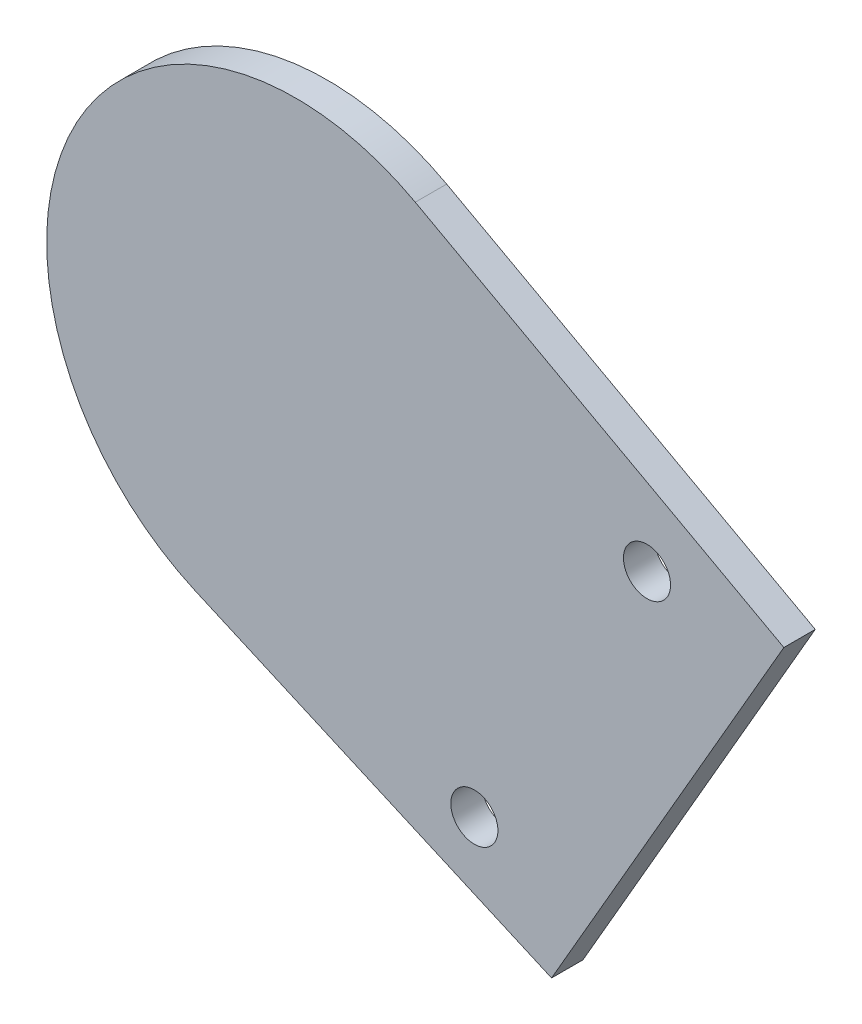
ISO-10303-21;
HEADER;
FILE_DESCRIPTION(('STEP AP214'),'2;1');
FILE_NAME('part.step','',(''),(''),'','','');
FILE_SCHEMA(('AUTOMOTIVE_DESIGN { 1 0 10303 214 1 1 1 1 }'));
ENDSEC;
DATA;
#1=APPLICATION_CONTEXT('core data for automotive mechanical design processes');
#2=APPLICATION_PROTOCOL_DEFINITION('international standard','automotive_design',2000,#1);
#3=PRODUCT_CONTEXT('',#1,'mechanical');
#4=PRODUCT('Part','Part','',(#3));
#5=PRODUCT_RELATED_PRODUCT_CATEGORY('part','',(#4));
#6=PRODUCT_DEFINITION_FORMATION('','',#4);
#7=PRODUCT_DEFINITION_CONTEXT('part definition',#1,'design');
#8=PRODUCT_DEFINITION('design','',#6,#7);
#9=PRODUCT_DEFINITION_SHAPE('','',#8);
#10=(LENGTH_UNIT() NAMED_UNIT(*) SI_UNIT(.MILLI.,.METRE.));
#11=(NAMED_UNIT(*) PLANE_ANGLE_UNIT() SI_UNIT($,.RADIAN.));
#12=(NAMED_UNIT(*) SI_UNIT($,.STERADIAN.) SOLID_ANGLE_UNIT());
#13=UNCERTAINTY_MEASURE_WITH_UNIT(LENGTH_MEASURE(1.E-05),#10,'distance_accuracy_value','');
#14=(GEOMETRIC_REPRESENTATION_CONTEXT(3) GLOBAL_UNCERTAINTY_ASSIGNED_CONTEXT((#13)) GLOBAL_UNIT_ASSIGNED_CONTEXT((#10,
#11,#12)) REPRESENTATION_CONTEXT('',''));
#15=CARTESIAN_POINT('',(0.,0.,0.));
#16=DIRECTION('',(0.,0.,1.));
#17=DIRECTION('',(1.,0.,0.));
#18=AXIS2_PLACEMENT_3D('',#15,#16,#17);
#19=CARTESIAN_POINT('',(8.61285407631744,27.3164832240439,-1.));
#20=DIRECTION('',(0.30070579948342,0.953716950754802,0.));
#21=DIRECTION('',(-0.953716950754802,0.30070579948342,0.));
#22=AXIS2_PLACEMENT_3D('',#19,#20,#21);
#23=PLANE('',#22);
#24=DIRECTION('',(-0.953716950754802,0.30070579948342,0.));
#25=VECTOR('',#24,1.);
#26=CARTESIAN_POINT('',(8.61285407631744,27.3164832240439,0.));
#27=LINE('',#26,#25);
#28=CARTESIAN_POINT('',(8.04581507237981,27.4952699352189,0.));
#29=VERTEX_POINT('',#28);
#30=CARTESIAN_POINT('',(-0.183811683162791,30.0900612839698,0.));
#31=VERTEX_POINT('',#30);
#32=EDGE_CURVE('E119',#29,#31,#27,.T.);
#33=ORIENTED_EDGE('',*,*,#32,.T.);
#34=DIRECTION('',(0.,0.,1.));
#35=VECTOR('',#34,1.);
#36=CARTESIAN_POINT('',(-0.183811683162791,30.0900612839698,-1.));
#37=LINE('',#36,#35);
#38=CARTESIAN_POINT('',(-0.183811683162791,30.0900612839698,-1.));
#39=VERTEX_POINT('',#38);
#40=EDGE_CURVE('E11',#39,#31,#37,.T.);
#41=ORIENTED_EDGE('',*,*,#40,.F.);
#42=DIRECTION('',(-0.953716950754802,0.30070579948342,0.));
#43=VECTOR('',#42,1.);
#44=CARTESIAN_POINT('',(8.61285407631744,27.3164832240439,-1.));
#45=LINE('',#44,#43);
#46=CARTESIAN_POINT('',(8.04581507237981,27.4952699352189,-1.));
#47=VERTEX_POINT('',#46);
#48=EDGE_CURVE('E53',#47,#39,#45,.T.);
#49=ORIENTED_EDGE('',*,*,#48,.F.);
#50=DIRECTION('',(0.,0.,1.));
#51=VECTOR('',#50,1.);
#52=CARTESIAN_POINT('',(8.04581507237981,27.4952699352189,-1.));
#53=LINE('',#52,#51);
#54=EDGE_CURVE('E38',#47,#29,#53,.T.);
#55=ORIENTED_EDGE('',*,*,#54,.T.);
#56=EDGE_LOOP('',(#33,#41,#49,#55));
#57=FACE_BOUND('',#56,.T.);
#58=ADVANCED_FACE('F35',(#57),#23,.F.);
#59=CARTESIAN_POINT('',(-6.66733957619966,41.2134371681631,-1.));
#60=DIRECTION('',(0.,0.,1.));
#61=DIRECTION('',(1.,0.,0.));
#62=AXIS2_PLACEMENT_3D('',#59,#60,#61);
#63=CYLINDRICAL_SURFACE('',#62,12.8750000000327);
#64=CARTESIAN_POINT('',(-6.66733957619966,41.2134371681631,0.));
#65=DIRECTION('',(0.,0.,1.));
#66=DIRECTION('',(1.,0.,0.));
#67=AXIS2_PLACEMENT_3D('',#64,#65,#66);
#68=CIRCLE('',#67,12.8750000000327);
#69=CARTESIAN_POINT('',(6.20755046187521,41.1602252491835,0.));
#70=VERTEX_POINT('',#69);
#71=EDGE_CURVE('E132',#70,#31,#68,.T.);
#72=ORIENTED_EDGE('',*,*,#71,.F.);
#73=DIRECTION('',(0.,0.,1.));
#74=VECTOR('',#73,1.);
#75=CARTESIAN_POINT('',(6.20755046187521,41.1602252491835,-1.));
#76=LINE('',#75,#74);
#77=CARTESIAN_POINT('',(6.20755046187521,41.1602252491835,-1.));
#78=VERTEX_POINT('',#77);
#79=EDGE_CURVE('E44',#78,#70,#76,.T.);
#80=ORIENTED_EDGE('',*,*,#79,.F.);
#81=CARTESIAN_POINT('',(-6.66733957619966,41.2134371681631,-1.));
#82=DIRECTION('',(0.,0.,1.));
#83=DIRECTION('',(1.,0.,0.));
#84=AXIS2_PLACEMENT_3D('',#81,#82,#83);
#85=CIRCLE('',#84,12.8750000000327);
#86=EDGE_CURVE('E109',#78,#39,#85,.T.);
#87=ORIENTED_EDGE('',*,*,#86,.T.);
#88=ORIENTED_EDGE('',*,*,#40,.T.);
#89=EDGE_LOOP('',(#72,#80,#87,#88));
#90=FACE_BOUND('',#89,.T.);
#91=ADVANCED_FACE('F145',(#90),#63,.T.);
#92=CARTESIAN_POINT('',(23.3350624785849,25.4657520533921,-1.));
#93=DIRECTION('',(0.675590207651282,0.737277336777483,0.));
#94=DIRECTION('',(-0.737277336777483,0.675590207651282,0.));
#95=AXIS2_PLACEMENT_3D('',#92,#93,#94);
#96=PLANE('',#95);
#97=DIRECTION('',(-0.737277336777483,0.675590207651282,0.));
#98=VECTOR('',#97,1.);
#99=CARTESIAN_POINT('',(23.3350624785849,25.4657520533921,0.));
#100=LINE('',#99,#98);
#101=CARTESIAN_POINT('',(12.5695190653247,35.3305550891572,0.));
#102=VERTEX_POINT('',#101);
#103=EDGE_CURVE('E99',#102,#70,#100,.T.);
#104=ORIENTED_EDGE('',*,*,#103,.F.);
#105=DIRECTION('',(0.,0.,1.));
#106=VECTOR('',#105,1.);
#107=CARTESIAN_POINT('',(12.5695190653247,35.3305550891572,-1.));
#108=LINE('',#107,#106);
#109=CARTESIAN_POINT('',(12.5695190653247,35.3305550891572,-1.));
#110=VERTEX_POINT('',#109);
#111=EDGE_CURVE('E75',#110,#102,#108,.T.);
#112=ORIENTED_EDGE('',*,*,#111,.F.);
#113=DIRECTION('',(-0.737277336777483,0.675590207651282,0.));
#114=VECTOR('',#113,1.);
#115=CARTESIAN_POINT('',(23.3350624785849,25.4657520533921,-1.));
#116=LINE('',#115,#114);
#117=EDGE_CURVE('E97',#110,#78,#116,.T.);
#118=ORIENTED_EDGE('',*,*,#117,.T.);
#119=ORIENTED_EDGE('',*,*,#79,.T.);
#120=EDGE_LOOP('',(#104,#112,#118,#119));
#121=FACE_BOUND('',#120,.T.);
#122=ADVANCED_FACE('F96',(#121),#96,.T.);
#123=CARTESIAN_POINT('',(9.43914661924816,31.9143530275722,-1.));
#124=DIRECTION('',(0.,0.,1.));
#125=DIRECTION('',(1.,0.,0.));
#126=AXIS2_PLACEMENT_3D('',#123,#124,#125);
#127=CYLINDRICAL_SURFACE('',#126,4.63353732872982);
#128=CARTESIAN_POINT('',(9.43914661924816,31.9143530275722,0.));
#129=DIRECTION('',(0.,0.,1.));
#130=DIRECTION('',(1.,0.,0.));
#131=AXIS2_PLACEMENT_3D('',#128,#129,#130);
#132=CIRCLE('',#131,4.63353732872982);
#133=CARTESIAN_POINT('',(13.8409345303533,33.3613953083579,0.));
#134=VERTEX_POINT('',#133);
#135=EDGE_CURVE('E129',#134,#102,#132,.T.);
#136=ORIENTED_EDGE('',*,*,#135,.F.);
#137=DIRECTION('',(0.,0.,1.));
#138=VECTOR('',#137,1.);
#139=CARTESIAN_POINT('',(13.8409345303533,33.3613953083579,-1.));
#140=LINE('',#139,#138);
#141=CARTESIAN_POINT('',(13.8409345303533,33.3613953083579,-1.));
#142=VERTEX_POINT('',#141);
#143=EDGE_CURVE('E101',#142,#134,#140,.T.);
#144=ORIENTED_EDGE('',*,*,#143,.F.);
#145=CARTESIAN_POINT('',(9.43914661924816,31.9143530275722,-1.));
#146=DIRECTION('',(0.,0.,1.));
#147=DIRECTION('',(1.,0.,0.));
#148=AXIS2_PLACEMENT_3D('',#145,#146,#147);
#149=CIRCLE('',#148,4.63353732872982);
#150=EDGE_CURVE('E106',#142,#110,#149,.T.);
#151=ORIENTED_EDGE('',*,*,#150,.T.);
#152=ORIENTED_EDGE('',*,*,#111,.T.);
#153=EDGE_LOOP('',(#136,#144,#151,#152));
#154=FACE_BOUND('',#153,.T.);
#155=ADVANCED_FACE('F111',(#154),#127,.T.);
#156=CARTESIAN_POINT('',(7.72752043028929,-1.36056634220429,-1.));
#157=DIRECTION('',(0.984851398652931,-0.173400468774928,0.));
#158=DIRECTION('',(0.173400468774928,0.984851398652931,0.));
#159=AXIS2_PLACEMENT_3D('',#156,#157,#158);
#160=PLANE('',#159);
#161=DIRECTION('',(0.173400468774928,0.984851398652931,0.));
#162=VECTOR('',#161,1.);
#163=CARTESIAN_POINT('',(7.72752043028929,-1.36056634220429,0.));
#164=LINE('',#163,#162);
#165=CARTESIAN_POINT('',(13.0819975429926,29.0509101131778,0.));
#166=VERTEX_POINT('',#165);
#167=EDGE_CURVE('E126',#166,#134,#164,.T.);
#168=ORIENTED_EDGE('',*,*,#167,.F.);
#169=DIRECTION('',(0.,0.,1.));
#170=VECTOR('',#169,1.);
#171=CARTESIAN_POINT('',(13.0819975429926,29.0509101131778,-1.));
#172=LINE('',#171,#170);
#173=CARTESIAN_POINT('',(13.0819975429926,29.0509101131778,-1.));
#174=VERTEX_POINT('',#173);
#175=EDGE_CURVE('E136',#174,#166,#172,.T.);
#176=ORIENTED_EDGE('',*,*,#175,.F.);
#177=DIRECTION('',(0.173400468774928,0.984851398652931,0.));
#178=VECTOR('',#177,1.);
#179=CARTESIAN_POINT('',(7.72752043028929,-1.36056634220429,-1.));
#180=LINE('',#179,#178);
#181=EDGE_CURVE('E112',#174,#142,#180,.T.);
#182=ORIENTED_EDGE('',*,*,#181,.T.);
#183=ORIENTED_EDGE('',*,*,#143,.T.);
#184=EDGE_LOOP('',(#168,#176,#182,#183));
#185=FACE_BOUND('',#184,.T.);
#186=ADVANCED_FACE('F158',(#185),#160,.T.);
#187=CARTESIAN_POINT('',(9.43914661924816,31.9143530275722,-1.));
#188=DIRECTION('',(0.,0.,1.));
#189=DIRECTION('',(1.,0.,0.));
#190=AXIS2_PLACEMENT_3D('',#187,#188,#189);
#191=CYLINDRICAL_SURFACE('',#190,4.63353732871778);
#192=CARTESIAN_POINT('',(9.43914661924816,31.9143530275722,0.));
#193=DIRECTION('',(0.,0.,1.));
#194=DIRECTION('',(1.,0.,0.));
#195=AXIS2_PLACEMENT_3D('',#192,#193,#194);
#196=CIRCLE('',#195,4.63353732871778);
#197=EDGE_CURVE('E122',#29,#166,#196,.T.);
#198=ORIENTED_EDGE('',*,*,#197,.F.);
#199=ORIENTED_EDGE('',*,*,#54,.F.);
#200=CARTESIAN_POINT('',(9.43914661924816,31.9143530275722,-1.));
#201=DIRECTION('',(0.,0.,1.));
#202=DIRECTION('',(1.,0.,0.));
#203=AXIS2_PLACEMENT_3D('',#200,#201,#202);
#204=CIRCLE('',#203,4.63353732871778);
#205=EDGE_CURVE('E114',#47,#174,#204,.T.);
#206=ORIENTED_EDGE('',*,*,#205,.T.);
#207=ORIENTED_EDGE('',*,*,#175,.T.);
#208=EDGE_LOOP('',(#198,#199,#206,#207));
#209=FACE_BOUND('',#208,.T.);
#210=ADVANCED_FACE('F140',(#209),#191,.T.);
#211=CARTESIAN_POINT('',(0.,0.,-1.));
#212=DIRECTION('',(0.,0.,1.));
#213=DIRECTION('',(1.,0.,0.));
#214=AXIS2_PLACEMENT_3D('',#211,#212,#213);
#215=PLANE('',#214);
#216=ORIENTED_EDGE('',*,*,#48,.T.);
#217=ORIENTED_EDGE('',*,*,#86,.F.);
#218=ORIENTED_EDGE('',*,*,#117,.F.);
#219=ORIENTED_EDGE('',*,*,#150,.F.);
#220=ORIENTED_EDGE('',*,*,#181,.F.);
#221=ORIENTED_EDGE('',*,*,#205,.F.);
#222=EDGE_LOOP('',(#216,#217,#218,#219,#220,#221));
#223=FACE_BOUND('',#222,.T.);
#224=ADVANCED_FACE('F104',(#223),#215,.F.);
#225=CARTESIAN_POINT('',(0.,0.,0.));
#226=DIRECTION('',(0.,0.,1.));
#227=DIRECTION('',(1.,0.,0.));
#228=AXIS2_PLACEMENT_3D('',#225,#226,#227);
#229=PLANE('',#228);
#230=CARTESIAN_POINT('',(15.7092008094,42.1507420136,0.));
#231=DIRECTION('',(0.,0.,1.));
#232=DIRECTION('',(1.,0.,0.));
#233=AXIS2_PLACEMENT_3D('',#230,#231,#232);
#234=CIRCLE('',#233,1.5);
#235=CARTESIAN_POINT('',(17.2092008094,42.1507420136,0.));
#236=VERTEX_POINT('',#235);
#237=EDGE_CURVE('E239',#236,#236,#234,.T.);
#238=ORIENTED_EDGE('',*,*,#237,.T.);
#239=EDGE_LOOP('',(#238));
#240=FACE_BOUND('',#239,.T.);
#241=CARTESIAN_POINT('',(4.7092008094,23.0981831303,0.));
#242=DIRECTION('',(0.,0.,1.));
#243=DIRECTION('',(1.,0.,0.));
#244=AXIS2_PLACEMENT_3D('',#241,#242,#243);
#245=CIRCLE('',#244,1.5);
#246=CARTESIAN_POINT('',(6.2092008094,23.0981831303,0.));
#247=VERTEX_POINT('',#246);
#248=EDGE_CURVE('E233',#247,#247,#245,.T.);
#249=ORIENTED_EDGE('',*,*,#248,.T.);
#250=EDGE_LOOP('',(#249));
#251=FACE_BOUND('',#250,.T.);
#252=DIRECTION('',(0.499999999996147,0.866025403786663,0.));
#253=VECTOR('',#252,1.);
#254=CARTESIAN_POINT('',(1.48017048155558E-10,-8.5457682596387E-11,0.));
#255=LINE('',#254,#253);
#256=CARTESIAN_POINT('',(9.62775726576662,16.6757647471871,0.));
#257=VERTEX_POINT('',#256);
#258=CARTESIAN_POINT('',(24.4299756112762,42.3139589863824,0.));
#259=VERTEX_POINT('',#258);
#260=EDGE_CURVE('E221',#257,#259,#255,.T.);
#261=ORIENTED_EDGE('',*,*,#260,.F.);
#262=DIRECTION('',(-0.914956887839991,0.40355159941965,0.));
#263=VECTOR('',#262,1.);
#264=CARTESIAN_POINT('',(7.72514898551862,17.5149306409767,0.));
#265=LINE('',#264,#263);
#266=CARTESIAN_POINT('',(-13.07372121693,26.6884965738315,0.));
#267=VERTEX_POINT('',#266);
#268=EDGE_CURVE('E231',#257,#267,#265,.T.);
#269=ORIENTED_EDGE('',*,*,#268,.T.);
#270=CARTESIAN_POINT('',(-6.66733957619966,41.2134371681631,0.));
#271=DIRECTION('',(0.,0.,1.));
#272=DIRECTION('',(1.,0.,0.));
#273=AXIS2_PLACEMENT_3D('',#270,#271,#272);
#274=CIRCLE('',#273,15.8749999998598);
#275=CARTESIAN_POINT('',(0.943725210260444,55.144959619491,0.));
#276=VERTEX_POINT('',#275);
#277=EDGE_CURVE('E220',#276,#267,#274,.T.);
#278=ORIENTED_EDGE('',*,*,#277,.F.);
#279=DIRECTION('',(-0.877576217414237,0.479437151907234,0.));
#280=VECTOR('',#279,1.);
#281=CARTESIAN_POINT('',(23.4187606779857,42.8664055978133,0.));
#282=LINE('',#281,#280);
#283=EDGE_CURVE('E206',#259,#276,#282,.T.);
#284=ORIENTED_EDGE('',*,*,#283,.F.);
#285=EDGE_LOOP('',(#261,#269,#278,#284));
#286=FACE_BOUND('',#285,.T.);
#287=ORIENTED_EDGE('',*,*,#32,.F.);
#288=ORIENTED_EDGE('',*,*,#197,.T.);
#289=ORIENTED_EDGE('',*,*,#167,.T.);
#290=ORIENTED_EDGE('',*,*,#135,.T.);
#291=ORIENTED_EDGE('',*,*,#103,.T.);
#292=ORIENTED_EDGE('',*,*,#71,.T.);
#293=EDGE_LOOP('',(#287,#288,#289,#290,#291,#292));
#294=FACE_BOUND('',#293,.T.);
#295=ADVANCED_FACE('F142',(#240,#251,#286,#294),#229,.F.);
#296=CARTESIAN_POINT('',(1.48017048155558E-10,-8.5457682596387E-11,2.));
#297=DIRECTION('',(-0.866025403786663,0.499999999996147,0.));
#298=DIRECTION('',(-0.499999999996147,-0.866025403786663,0.));
#299=AXIS2_PLACEMENT_3D('',#296,#297,#298);
#300=PLANE('',#299);
#301=ORIENTED_EDGE('',*,*,#260,.T.);
#302=DIRECTION('',(0.,0.,-1.));
#303=VECTOR('',#302,1.);
#304=CARTESIAN_POINT('',(24.4299756112762,42.3139589863824,2.));
#305=LINE('',#304,#303);
#306=CARTESIAN_POINT('',(24.4299756112762,42.3139589863824,2.));
#307=VERTEX_POINT('',#306);
#308=EDGE_CURVE('E123',#307,#259,#305,.T.);
#309=ORIENTED_EDGE('',*,*,#308,.F.);
#310=DIRECTION('',(0.499999999996147,0.866025403786663,0.));
#311=VECTOR('',#310,1.);
#312=CARTESIAN_POINT('',(1.48017048155558E-10,-8.5457682596387E-11,2.));
#313=LINE('',#312,#311);
#314=CARTESIAN_POINT('',(9.62775726576662,16.6757647471871,2.));
#315=VERTEX_POINT('',#314);
#316=EDGE_CURVE('E241',#315,#307,#313,.T.);
#317=ORIENTED_EDGE('',*,*,#316,.F.);
#318=DIRECTION('',(0.,0.,-1.));
#319=VECTOR('',#318,1.);
#320=CARTESIAN_POINT('',(9.62775726576662,16.6757647471871,2.));
#321=LINE('',#320,#319);
#322=EDGE_CURVE('E242',#315,#257,#321,.T.);
#323=ORIENTED_EDGE('',*,*,#322,.T.);
#324=EDGE_LOOP('',(#301,#309,#317,#323));
#325=FACE_BOUND('',#324,.T.);
#326=ADVANCED_FACE('F168',(#325),#300,.F.);
#327=CARTESIAN_POINT('',(23.4187606779857,42.8664055978133,2.));
#328=DIRECTION('',(-0.479437151907234,-0.877576217414237,0.));
#329=DIRECTION('',(0.877576217414237,-0.479437151907234,0.));
#330=AXIS2_PLACEMENT_3D('',#327,#328,#329);
#331=PLANE('',#330);
#332=ORIENTED_EDGE('',*,*,#283,.T.);
#333=DIRECTION('',(0.,0.,-1.));
#334=VECTOR('',#333,1.);
#335=CARTESIAN_POINT('',(0.943725210260444,55.144959619491,2.));
#336=LINE('',#335,#334);
#337=CARTESIAN_POINT('',(0.943725210260444,55.144959619491,2.));
#338=VERTEX_POINT('',#337);
#339=EDGE_CURVE('E210',#338,#276,#336,.T.);
#340=ORIENTED_EDGE('',*,*,#339,.F.);
#341=DIRECTION('',(-0.877576217414237,0.479437151907234,0.));
#342=VECTOR('',#341,1.);
#343=CARTESIAN_POINT('',(23.4187606779857,42.8664055978133,2.));
#344=LINE('',#343,#342);
#345=EDGE_CURVE('E265',#307,#338,#344,.T.);
#346=ORIENTED_EDGE('',*,*,#345,.F.);
#347=ORIENTED_EDGE('',*,*,#308,.T.);
#348=EDGE_LOOP('',(#332,#340,#346,#347));
#349=FACE_BOUND('',#348,.T.);
#350=ADVANCED_FACE('F174',(#349),#331,.F.);
#351=CARTESIAN_POINT('',(-6.66733957619966,41.2134371681631,2.));
#352=DIRECTION('',(0.,0.,-1.));
#353=DIRECTION('',(-1.,0.,0.));
#354=AXIS2_PLACEMENT_3D('',#351,#352,#353);
#355=CYLINDRICAL_SURFACE('',#354,15.8749999998598);
#356=ORIENTED_EDGE('',*,*,#277,.T.);
#357=DIRECTION('',(0.,0.,-1.));
#358=VECTOR('',#357,1.);
#359=CARTESIAN_POINT('',(-13.07372121693,26.6884965738315,2.));
#360=LINE('',#359,#358);
#361=CARTESIAN_POINT('',(-13.07372121693,26.6884965738315,2.));
#362=VERTEX_POINT('',#361);
#363=EDGE_CURVE('E228',#362,#267,#360,.T.);
#364=ORIENTED_EDGE('',*,*,#363,.F.);
#365=CARTESIAN_POINT('',(-6.66733957619966,41.2134371681631,2.));
#366=DIRECTION('',(0.,0.,1.));
#367=DIRECTION('',(1.,0.,0.));
#368=AXIS2_PLACEMENT_3D('',#365,#366,#367);
#369=CIRCLE('',#368,15.8749999998598);
#370=EDGE_CURVE('E227',#338,#362,#369,.T.);
#371=ORIENTED_EDGE('',*,*,#370,.F.);
#372=ORIENTED_EDGE('',*,*,#339,.T.);
#373=EDGE_LOOP('',(#356,#364,#371,#372));
#374=FACE_BOUND('',#373,.T.);
#375=ADVANCED_FACE('F189',(#374),#355,.T.);
#376=CARTESIAN_POINT('',(4.7092008094,23.0981831303,2.));
#377=DIRECTION('',(0.,0.,-1.));
#378=DIRECTION('',(-1.,0.,0.));
#379=AXIS2_PLACEMENT_3D('',#376,#377,#378);
#380=CYLINDRICAL_SURFACE('',#379,1.5);
#381=CARTESIAN_POINT('',(4.7092008094,23.0981831303,2.));
#382=DIRECTION('',(0.,0.,1.));
#383=DIRECTION('',(1.,0.,0.));
#384=AXIS2_PLACEMENT_3D('',#381,#382,#383);
#385=CIRCLE('',#384,1.5);
#386=CARTESIAN_POINT('',(6.2092008094,23.0981831303,2.));
#387=VERTEX_POINT('',#386);
#388=EDGE_CURVE('E273',#387,#387,#385,.T.);
#389=ORIENTED_EDGE('',*,*,#388,.T.);
#390=EDGE_LOOP('',(#389));
#391=FACE_BOUND('',#390,.T.);
#392=ORIENTED_EDGE('',*,*,#248,.F.);
#393=EDGE_LOOP('',(#392));
#394=FACE_BOUND('',#393,.T.);
#395=ADVANCED_FACE('F186',(#391,#394),#380,.F.);
#396=CARTESIAN_POINT('',(7.72514898551862,17.5149306409767,2.));
#397=DIRECTION('',(-0.40355159941965,-0.914956887839991,0.));
#398=DIRECTION('',(0.914956887839991,-0.40355159941965,0.));
#399=AXIS2_PLACEMENT_3D('',#396,#397,#398);
#400=PLANE('',#399);
#401=ORIENTED_EDGE('',*,*,#268,.F.);
#402=ORIENTED_EDGE('',*,*,#322,.F.);
#403=DIRECTION('',(-0.914956887839991,0.40355159941965,0.));
#404=VECTOR('',#403,1.);
#405=CARTESIAN_POINT('',(7.72514898551862,17.5149306409767,2.));
#406=LINE('',#405,#404);
#407=EDGE_CURVE('E254',#315,#362,#406,.T.);
#408=ORIENTED_EDGE('',*,*,#407,.T.);
#409=ORIENTED_EDGE('',*,*,#363,.T.);
#410=EDGE_LOOP('',(#401,#402,#408,#409));
#411=FACE_BOUND('',#410,.T.);
#412=ADVANCED_FACE('F184',(#411),#400,.T.);
#413=CARTESIAN_POINT('',(15.7092008094,42.1507420136,2.));
#414=DIRECTION('',(0.,0.,-1.));
#415=DIRECTION('',(-1.,0.,0.));
#416=AXIS2_PLACEMENT_3D('',#413,#414,#415);
#417=CYLINDRICAL_SURFACE('',#416,1.5);
#418=CARTESIAN_POINT('',(15.7092008094,42.1507420136,2.));
#419=DIRECTION('',(0.,0.,1.));
#420=DIRECTION('',(1.,0.,0.));
#421=AXIS2_PLACEMENT_3D('',#418,#419,#420);
#422=CIRCLE('',#421,1.5);
#423=CARTESIAN_POINT('',(17.2092008094,42.1507420136,2.));
#424=VERTEX_POINT('',#423);
#425=EDGE_CURVE('E245',#424,#424,#422,.T.);
#426=ORIENTED_EDGE('',*,*,#425,.T.);
#427=EDGE_LOOP('',(#426));
#428=FACE_BOUND('',#427,.T.);
#429=ORIENTED_EDGE('',*,*,#237,.F.);
#430=EDGE_LOOP('',(#429));
#431=FACE_BOUND('',#430,.T.);
#432=ADVANCED_FACE('F181',(#428,#431),#417,.F.);
#433=CARTESIAN_POINT('',(0.,0.,2.));
#434=DIRECTION('',(0.,0.,1.));
#435=DIRECTION('',(1.,0.,0.));
#436=AXIS2_PLACEMENT_3D('',#433,#434,#435);
#437=PLANE('',#436);
#438=ORIENTED_EDGE('',*,*,#316,.T.);
#439=ORIENTED_EDGE('',*,*,#345,.T.);
#440=ORIENTED_EDGE('',*,*,#370,.T.);
#441=ORIENTED_EDGE('',*,*,#407,.F.);
#442=EDGE_LOOP('',(#438,#439,#440,#441));
#443=FACE_BOUND('',#442,.T.);
#444=ORIENTED_EDGE('',*,*,#388,.F.);
#445=EDGE_LOOP('',(#444));
#446=FACE_BOUND('',#445,.T.);
#447=ORIENTED_EDGE('',*,*,#425,.F.);
#448=EDGE_LOOP('',(#447));
#449=FACE_BOUND('',#448,.T.);
#450=ADVANCED_FACE('F180',(#443,#446,#449),#437,.T.);
#451=CLOSED_SHELL('',(#58,#91,#122,#155,#186,#210,#224,#295,#326,#350,#375,#395,#412,#432,#450));
#452=MANIFOLD_SOLID_BREP('B2',#451);
#453=ADVANCED_BREP_SHAPE_REPRESENTATION('',(#18,#452),#14);
#454=SHAPE_DEFINITION_REPRESENTATION(#9,#453);
ENDSEC;
END-ISO-10303-21;
